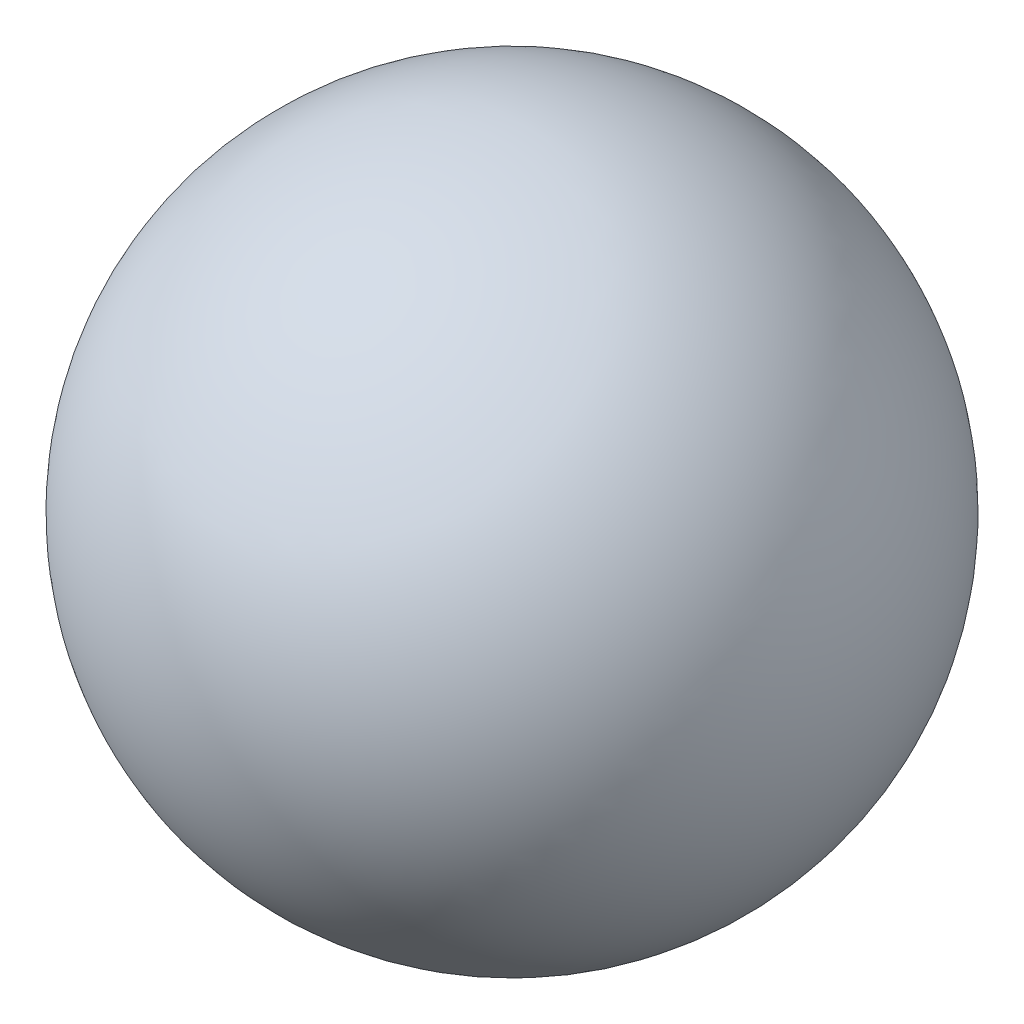
ISO-10303-21;
HEADER;
FILE_DESCRIPTION(('STEP AP214'),'2;1');
FILE_NAME('part.step','',(''),(''),'','','');
FILE_SCHEMA(('AUTOMOTIVE_DESIGN { 1 0 10303 214 1 1 1 1 }'));
ENDSEC;
DATA;
#1=APPLICATION_CONTEXT('core data for automotive mechanical design processes');
#2=APPLICATION_PROTOCOL_DEFINITION('international standard','automotive_design',2000,#1);
#3=PRODUCT_CONTEXT('',#1,'mechanical');
#4=PRODUCT('Part','Part','',(#3));
#5=PRODUCT_RELATED_PRODUCT_CATEGORY('part','',(#4));
#6=PRODUCT_DEFINITION_FORMATION('','',#4);
#7=PRODUCT_DEFINITION_CONTEXT('part definition',#1,'design');
#8=PRODUCT_DEFINITION('design','',#6,#7);
#9=PRODUCT_DEFINITION_SHAPE('','',#8);
#10=(LENGTH_UNIT() NAMED_UNIT(*) SI_UNIT(.MILLI.,.METRE.));
#11=(NAMED_UNIT(*) PLANE_ANGLE_UNIT() SI_UNIT($,.RADIAN.));
#12=(NAMED_UNIT(*) SI_UNIT($,.STERADIAN.) SOLID_ANGLE_UNIT());
#13=UNCERTAINTY_MEASURE_WITH_UNIT(LENGTH_MEASURE(1.E-05),#10,'distance_accuracy_value','');
#14=(GEOMETRIC_REPRESENTATION_CONTEXT(3) GLOBAL_UNCERTAINTY_ASSIGNED_CONTEXT((#13)) GLOBAL_UNIT_ASSIGNED_CONTEXT((#10,
#11,#12)) REPRESENTATION_CONTEXT('',''));
#15=CARTESIAN_POINT('',(0.,0.,0.));
#16=DIRECTION('',(0.,0.,1.));
#17=DIRECTION('',(1.,0.,0.));
#18=AXIS2_PLACEMENT_3D('',#15,#16,#17);
#19=CARTESIAN_POINT('',(3.31035754288681,-2.,-11.2740424399703));
#20=DIRECTION('',(0.,0.,1.));
#21=DIRECTION('',(1.,0.,0.));
#22=AXIS2_PLACEMENT_3D('',#19,#20,#21);
#23=SPHERICAL_SURFACE('',#22,1.05);
#24=CARTESIAN_POINT('',(3.31035754288681,-2.,-10.2240424399703));
#25=VERTEX_POINT('',#24);
#26=VERTEX_LOOP('',#25);
#27=FACE_BOUND('',#26,.T.);
#28=ADVANCED_FACE('F12',(#27),#23,.T.);
#29=CLOSED_SHELL('',(#28));
#30=MANIFOLD_SOLID_BREP('B1',#29);
#31=ADVANCED_BREP_SHAPE_REPRESENTATION('',(#18,#30),#14);
#32=SHAPE_DEFINITION_REPRESENTATION(#9,#31);
ENDSEC;
END-ISO-10303-21;
